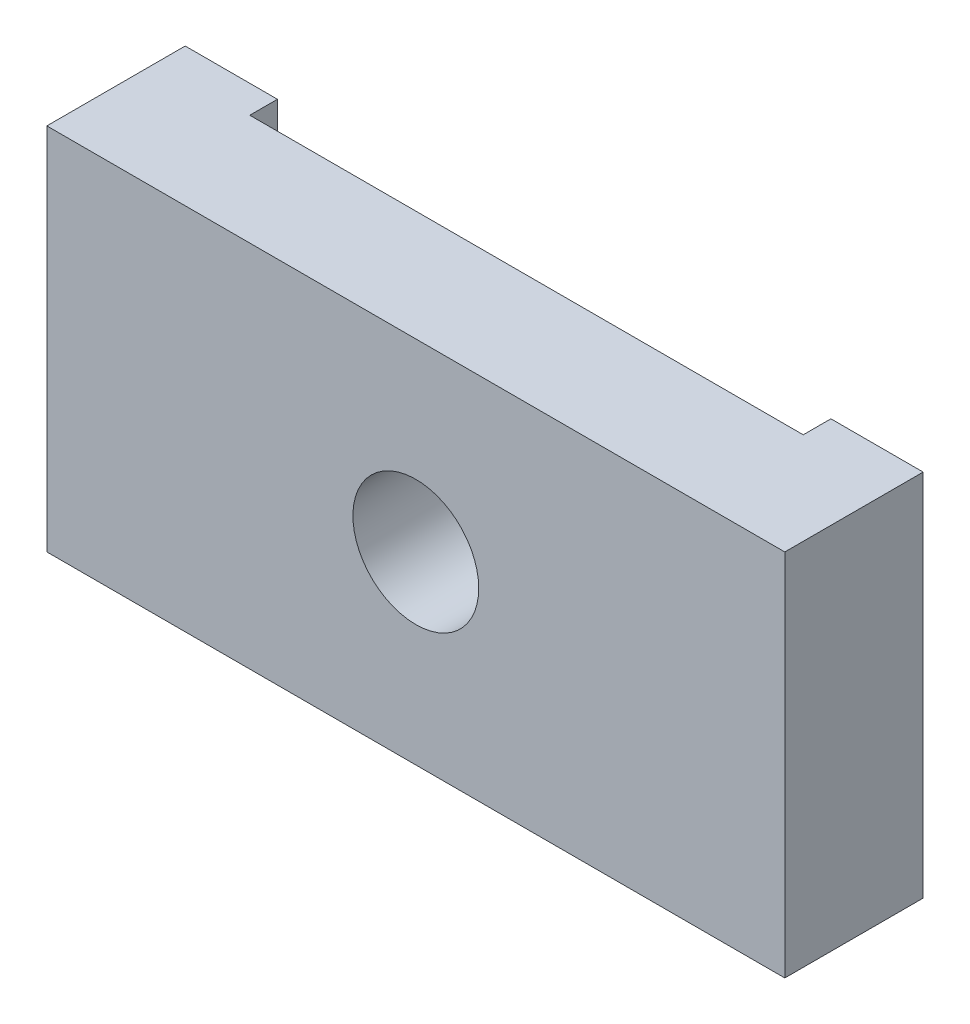
ISO-10303-21;
HEADER;
FILE_DESCRIPTION(('STEP AP214'),'2;1');
FILE_NAME('part.step','',(''),(''),'','','');
FILE_SCHEMA(('AUTOMOTIVE_DESIGN { 1 0 10303 214 1 1 1 1 }'));
ENDSEC;
DATA;
#1=APPLICATION_CONTEXT('core data for automotive mechanical design processes');
#2=APPLICATION_PROTOCOL_DEFINITION('international standard','automotive_design',2000,#1);
#3=PRODUCT_CONTEXT('',#1,'mechanical');
#4=PRODUCT('Part','Part','',(#3));
#5=PRODUCT_RELATED_PRODUCT_CATEGORY('part','',(#4));
#6=PRODUCT_DEFINITION_FORMATION('','',#4);
#7=PRODUCT_DEFINITION_CONTEXT('part definition',#1,'design');
#8=PRODUCT_DEFINITION('design','',#6,#7);
#9=PRODUCT_DEFINITION_SHAPE('','',#8);
#10=(LENGTH_UNIT() NAMED_UNIT(*) SI_UNIT(.MILLI.,.METRE.));
#11=(NAMED_UNIT(*) PLANE_ANGLE_UNIT() SI_UNIT($,.RADIAN.));
#12=(NAMED_UNIT(*) SI_UNIT($,.STERADIAN.) SOLID_ANGLE_UNIT());
#13=UNCERTAINTY_MEASURE_WITH_UNIT(LENGTH_MEASURE(1.E-05),#10,'distance_accuracy_value','');
#14=(GEOMETRIC_REPRESENTATION_CONTEXT(3) GLOBAL_UNCERTAINTY_ASSIGNED_CONTEXT((#13)) GLOBAL_UNIT_ASSIGNED_CONTEXT((#10,
#11,#12)) REPRESENTATION_CONTEXT('',''));
#15=CARTESIAN_POINT('',(0.,0.,0.));
#16=DIRECTION('',(0.,0.,1.));
#17=DIRECTION('',(1.,0.,0.));
#18=AXIS2_PLACEMENT_3D('',#15,#16,#17);
#19=CARTESIAN_POINT('',(0.,0.,-48.0642839424142));
#20=DIRECTION('',(0.,0.,1.));
#21=DIRECTION('',(1.,0.,0.));
#22=AXIS2_PLACEMENT_3D('',#19,#20,#21);
#23=CYLINDRICAL_SURFACE('',#22,4.3307);
#24=CARTESIAN_POINT('',(0.,0.,1.905));
#25=DIRECTION('',(0.,0.,1.));
#26=DIRECTION('',(1.,0.,0.));
#27=AXIS2_PLACEMENT_3D('',#24,#25,#26);
#28=CIRCLE('',#27,4.3307);
#29=CARTESIAN_POINT('',(4.3307,0.,1.905));
#30=VERTEX_POINT('',#29);
#31=EDGE_CURVE('E199',#30,#30,#28,.T.);
#32=ORIENTED_EDGE('',*,*,#31,.F.);
#33=EDGE_LOOP('',(#32));
#34=FACE_BOUND('',#33,.T.);
#35=CARTESIAN_POINT('',(0.,0.,9.525));
#36=DIRECTION('',(0.,0.,-1.));
#37=DIRECTION('',(0.,-1.,0.));
#38=AXIS2_PLACEMENT_3D('',#35,#36,#37);
#39=CIRCLE('',#38,4.3307);
#40=CARTESIAN_POINT('',(0.,-4.3307,9.525));
#41=VERTEX_POINT('',#40);
#42=EDGE_CURVE('E138',#41,#41,#39,.T.);
#43=ORIENTED_EDGE('',*,*,#42,.F.);
#44=EDGE_LOOP('',(#43));
#45=FACE_BOUND('',#44,.T.);
#46=ADVANCED_FACE('F15',(#34,#45),#23,.F.);
#47=CARTESIAN_POINT('',(22.225,-7.9375,6.90324241496963));
#48=DIRECTION('',(0.,0.,-1.));
#49=DIRECTION('',(1.,0.,0.));
#50=AXIS2_PLACEMENT_3D('',#47,#48,#49);
#51=CONICAL_SURFACE('',#50,0.92075,1.02974425867665);
#52=CARTESIAN_POINT('',(22.225,-7.9375,7.45648482993925));
#53=VERTEX_POINT('',#52);
#54=VERTEX_LOOP('',#53);
#55=FACE_BOUND('',#54,.T.);
#56=CARTESIAN_POINT('',(22.225,-7.9375,6.35));
#57=DIRECTION('',(0.,0.,1.));
#58=DIRECTION('',(1.,0.,0.));
#59=AXIS2_PLACEMENT_3D('',#56,#57,#58);
#60=CIRCLE('',#59,1.8415);
#61=CARTESIAN_POINT('',(24.0665,-7.9375,6.35));
#62=VERTEX_POINT('',#61);
#63=EDGE_CURVE('E9',#62,#62,#60,.T.);
#64=ORIENTED_EDGE('',*,*,#63,.F.);
#65=EDGE_LOOP('',(#64));
#66=FACE_BOUND('',#65,.T.);
#67=ADVANCED_FACE('F217',(#55,#66),#51,.F.);
#68=CARTESIAN_POINT('',(22.225,-7.9375,3.175));
#69=DIRECTION('',(0.,0.,1.));
#70=DIRECTION('',(1.,0.,0.));
#71=AXIS2_PLACEMENT_3D('',#68,#69,#70);
#72=CYLINDRICAL_SURFACE('',#71,1.8415);
#73=CARTESIAN_POINT('',(22.225,-7.9375,0.));
#74=DIRECTION('',(0.,0.,1.));
#75=DIRECTION('',(1.,0.,0.));
#76=AXIS2_PLACEMENT_3D('',#73,#74,#75);
#77=CIRCLE('',#76,1.8415);
#78=CARTESIAN_POINT('',(24.0665,-7.9375,0.));
#79=VERTEX_POINT('',#78);
#80=EDGE_CURVE('E134',#79,#79,#77,.T.);
#81=ORIENTED_EDGE('',*,*,#80,.F.);
#82=EDGE_LOOP('',(#81));
#83=FACE_BOUND('',#82,.T.);
#84=ORIENTED_EDGE('',*,*,#63,.T.);
#85=EDGE_LOOP('',(#84));
#86=FACE_BOUND('',#85,.T.);
#87=ADVANCED_FACE('F223',(#83,#86),#72,.F.);
#88=CARTESIAN_POINT('',(22.225,7.9375,6.90324241496963));
#89=DIRECTION('',(0.,0.,-1.));
#90=DIRECTION('',(1.,0.,0.));
#91=AXIS2_PLACEMENT_3D('',#88,#89,#90);
#92=CONICAL_SURFACE('',#91,0.92075,1.02974425867665);
#93=CARTESIAN_POINT('',(22.225,7.9375,7.45648482993925));
#94=VERTEX_POINT('',#93);
#95=VERTEX_LOOP('',#94);
#96=FACE_BOUND('',#95,.T.);
#97=CARTESIAN_POINT('',(22.225,7.9375,6.35));
#98=DIRECTION('',(0.,0.,1.));
#99=DIRECTION('',(1.,0.,0.));
#100=AXIS2_PLACEMENT_3D('',#97,#98,#99);
#101=CIRCLE('',#100,1.8415);
#102=CARTESIAN_POINT('',(24.0665,7.9375,6.35));
#103=VERTEX_POINT('',#102);
#104=EDGE_CURVE('E24',#103,#103,#101,.T.);
#105=ORIENTED_EDGE('',*,*,#104,.F.);
#106=EDGE_LOOP('',(#105));
#107=FACE_BOUND('',#106,.T.);
#108=ADVANCED_FACE('F259',(#96,#107),#92,.F.);
#109=CARTESIAN_POINT('',(22.225,7.9375,3.175));
#110=DIRECTION('',(0.,0.,1.));
#111=DIRECTION('',(1.,0.,0.));
#112=AXIS2_PLACEMENT_3D('',#109,#110,#111);
#113=CYLINDRICAL_SURFACE('',#112,1.8415);
#114=CARTESIAN_POINT('',(22.225,7.9375,0.));
#115=DIRECTION('',(0.,0.,1.));
#116=DIRECTION('',(1.,0.,0.));
#117=AXIS2_PLACEMENT_3D('',#114,#115,#116);
#118=CIRCLE('',#117,1.8415);
#119=CARTESIAN_POINT('',(24.0665,7.9375,0.));
#120=VERTEX_POINT('',#119);
#121=EDGE_CURVE('E181',#120,#120,#118,.T.);
#122=ORIENTED_EDGE('',*,*,#121,.F.);
#123=EDGE_LOOP('',(#122));
#124=FACE_BOUND('',#123,.T.);
#125=ORIENTED_EDGE('',*,*,#104,.T.);
#126=EDGE_LOOP('',(#125));
#127=FACE_BOUND('',#126,.T.);
#128=ADVANCED_FACE('F17',(#124,#127),#113,.F.);
#129=CARTESIAN_POINT('',(-22.225,-7.9375,6.90324241496963));
#130=DIRECTION('',(0.,0.,-1.));
#131=DIRECTION('',(0.,-1.,0.));
#132=AXIS2_PLACEMENT_3D('',#129,#130,#131);
#133=CONICAL_SURFACE('',#132,0.92075,1.02974425867665);
#134=CARTESIAN_POINT('',(-22.225,-7.9375,7.45648482993925));
#135=VERTEX_POINT('',#134);
#136=VERTEX_LOOP('',#135);
#137=FACE_BOUND('',#136,.T.);
#138=CARTESIAN_POINT('',(-22.225,-7.9375,6.35));
#139=DIRECTION('',(0.,0.,-1.));
#140=DIRECTION('',(0.,-1.,0.));
#141=AXIS2_PLACEMENT_3D('',#138,#139,#140);
#142=CIRCLE('',#141,1.8415);
#143=CARTESIAN_POINT('',(-22.225,-9.779,6.35));
#144=VERTEX_POINT('',#143);
#145=EDGE_CURVE('E190',#144,#144,#142,.T.);
#146=ORIENTED_EDGE('',*,*,#145,.T.);
#147=EDGE_LOOP('',(#146));
#148=FACE_BOUND('',#147,.T.);
#149=ADVANCED_FACE('F229',(#137,#148),#133,.F.);
#150=CARTESIAN_POINT('',(-22.225,-7.9375,3.175));
#151=DIRECTION('',(0.,0.,-1.));
#152=DIRECTION('',(0.,-1.,0.));
#153=AXIS2_PLACEMENT_3D('',#150,#151,#152);
#154=CYLINDRICAL_SURFACE('',#153,1.8415);
#155=CARTESIAN_POINT('',(-22.225,-7.9375,0.));
#156=DIRECTION('',(0.,0.,1.));
#157=DIRECTION('',(1.,0.,0.));
#158=AXIS2_PLACEMENT_3D('',#155,#156,#157);
#159=CIRCLE('',#158,1.8415);
#160=CARTESIAN_POINT('',(-20.3835,-7.9375,0.));
#161=VERTEX_POINT('',#160);
#162=EDGE_CURVE('E194',#161,#161,#159,.T.);
#163=ORIENTED_EDGE('',*,*,#162,.F.);
#164=EDGE_LOOP('',(#163));
#165=FACE_BOUND('',#164,.T.);
#166=ORIENTED_EDGE('',*,*,#145,.F.);
#167=EDGE_LOOP('',(#166));
#168=FACE_BOUND('',#167,.T.);
#169=ADVANCED_FACE('F232',(#165,#168),#154,.F.);
#170=CARTESIAN_POINT('',(-22.225,7.9375,6.90324241496963));
#171=DIRECTION('',(0.,0.,-1.));
#172=DIRECTION('',(0.,-1.,0.));
#173=AXIS2_PLACEMENT_3D('',#170,#171,#172);
#174=CONICAL_SURFACE('',#173,0.92075,1.02974425867665);
#175=CARTESIAN_POINT('',(-22.225,7.9375,7.45648482993925));
#176=VERTEX_POINT('',#175);
#177=VERTEX_LOOP('',#176);
#178=FACE_BOUND('',#177,.T.);
#179=CARTESIAN_POINT('',(-22.225,7.9375,6.35));
#180=DIRECTION('',(0.,0.,-1.));
#181=DIRECTION('',(0.,-1.,0.));
#182=AXIS2_PLACEMENT_3D('',#179,#180,#181);
#183=CIRCLE('',#182,1.8415);
#184=CARTESIAN_POINT('',(-22.225,6.096,6.35));
#185=VERTEX_POINT('',#184);
#186=EDGE_CURVE('E193',#185,#185,#183,.T.);
#187=ORIENTED_EDGE('',*,*,#186,.T.);
#188=EDGE_LOOP('',(#187));
#189=FACE_BOUND('',#188,.T.);
#190=ADVANCED_FACE('F235',(#178,#189),#174,.F.);
#191=CARTESIAN_POINT('',(-22.225,7.9375,3.175));
#192=DIRECTION('',(0.,0.,-1.));
#193=DIRECTION('',(0.,-1.,0.));
#194=AXIS2_PLACEMENT_3D('',#191,#192,#193);
#195=CYLINDRICAL_SURFACE('',#194,1.8415);
#196=CARTESIAN_POINT('',(-22.225,7.9375,0.));
#197=DIRECTION('',(0.,0.,1.));
#198=DIRECTION('',(1.,0.,0.));
#199=AXIS2_PLACEMENT_3D('',#196,#197,#198);
#200=CIRCLE('',#199,1.8415);
#201=CARTESIAN_POINT('',(-20.3835,7.9375,0.));
#202=VERTEX_POINT('',#201);
#203=EDGE_CURVE('E119',#202,#202,#200,.T.);
#204=ORIENTED_EDGE('',*,*,#203,.F.);
#205=EDGE_LOOP('',(#204));
#206=FACE_BOUND('',#205,.T.);
#207=ORIENTED_EDGE('',*,*,#186,.F.);
#208=EDGE_LOOP('',(#207));
#209=FACE_BOUND('',#208,.T.);
#210=ADVANCED_FACE('F213',(#206,#209),#195,.F.);
#211=CARTESIAN_POINT('',(-19.05,12.7,1.905));
#212=DIRECTION('',(0.,0.,1.));
#213=DIRECTION('',(1.,0.,0.));
#214=AXIS2_PLACEMENT_3D('',#211,#212,#213);
#215=PLANE('',#214);
#216=ORIENTED_EDGE('',*,*,#31,.T.);
#217=EDGE_LOOP('',(#216));
#218=FACE_BOUND('',#217,.T.);
#219=DIRECTION('',(1.,0.,0.));
#220=VECTOR('',#219,1.);
#221=CARTESIAN_POINT('',(3.175,-12.7,1.905));
#222=LINE('',#221,#220);
#223=CARTESIAN_POINT('',(-19.05,-12.7,1.905));
#224=VERTEX_POINT('',#223);
#225=CARTESIAN_POINT('',(19.05,-12.7,1.905));
#226=VERTEX_POINT('',#225);
#227=EDGE_CURVE('E88',#224,#226,#222,.T.);
#228=ORIENTED_EDGE('',*,*,#227,.F.);
#229=DIRECTION('',(0.,-1.,0.));
#230=VECTOR('',#229,1.);
#231=CARTESIAN_POINT('',(-19.05,12.7,1.905));
#232=LINE('',#231,#230);
#233=CARTESIAN_POINT('',(-19.05,12.7,1.905));
#234=VERTEX_POINT('',#233);
#235=EDGE_CURVE('E91',#234,#224,#232,.T.);
#236=ORIENTED_EDGE('',*,*,#235,.F.);
#237=DIRECTION('',(-1.,0.,0.));
#238=VECTOR('',#237,1.);
#239=CARTESIAN_POINT('',(-22.225,12.7,1.905));
#240=LINE('',#239,#238);
#241=CARTESIAN_POINT('',(19.05,12.7,1.905));
#242=VERTEX_POINT('',#241);
#243=EDGE_CURVE('E121',#242,#234,#240,.T.);
#244=ORIENTED_EDGE('',*,*,#243,.F.);
#245=DIRECTION('',(0.,-1.,0.));
#246=VECTOR('',#245,1.);
#247=CARTESIAN_POINT('',(19.05,12.7,1.905));
#248=LINE('',#247,#246);
#249=EDGE_CURVE('E94',#242,#226,#248,.T.);
#250=ORIENTED_EDGE('',*,*,#249,.T.);
#251=EDGE_LOOP('',(#228,#236,#244,#250));
#252=FACE_BOUND('',#251,.T.);
#253=ADVANCED_FACE('F90',(#218,#252),#215,.F.);
#254=CARTESIAN_POINT('',(19.05,12.7,1.905));
#255=DIRECTION('',(1.,0.,0.));
#256=DIRECTION('',(0.,0.,-1.));
#257=AXIS2_PLACEMENT_3D('',#254,#255,#256);
#258=PLANE('',#257);
#259=DIRECTION('',(0.,0.,-1.));
#260=VECTOR('',#259,1.);
#261=CARTESIAN_POINT('',(19.05,-12.7,0.9525));
#262=LINE('',#261,#260);
#263=CARTESIAN_POINT('',(19.05,-12.7,0.));
#264=VERTEX_POINT('',#263);
#265=EDGE_CURVE('E100',#226,#264,#262,.T.);
#266=ORIENTED_EDGE('',*,*,#265,.F.);
#267=ORIENTED_EDGE('',*,*,#249,.F.);
#268=DIRECTION('',(0.,0.,1.));
#269=VECTOR('',#268,1.);
#270=CARTESIAN_POINT('',(19.05,12.7,0.9525));
#271=LINE('',#270,#269);
#272=CARTESIAN_POINT('',(19.05,12.7,0.));
#273=VERTEX_POINT('',#272);
#274=EDGE_CURVE('E127',#273,#242,#271,.T.);
#275=ORIENTED_EDGE('',*,*,#274,.F.);
#276=DIRECTION('',(0.,1.,0.));
#277=VECTOR('',#276,1.);
#278=CARTESIAN_POINT('',(19.05,6.35,0.));
#279=LINE('',#278,#277);
#280=EDGE_CURVE('E115',#264,#273,#279,.T.);
#281=ORIENTED_EDGE('',*,*,#280,.F.);
#282=EDGE_LOOP('',(#266,#267,#275,#281));
#283=FACE_BOUND('',#282,.T.);
#284=ADVANCED_FACE('F204',(#283),#258,.F.);
#285=CARTESIAN_POINT('',(-19.05,12.7,0.));
#286=DIRECTION('',(-1.,0.,0.));
#287=DIRECTION('',(0.,0.,1.));
#288=AXIS2_PLACEMENT_3D('',#285,#286,#287);
#289=PLANE('',#288);
#290=DIRECTION('',(0.,0.,1.));
#291=VECTOR('',#290,1.);
#292=CARTESIAN_POINT('',(-19.05,-12.7,0.));
#293=LINE('',#292,#291);
#294=CARTESIAN_POINT('',(-19.05,-12.7,0.));
#295=VERTEX_POINT('',#294);
#296=EDGE_CURVE('E99',#295,#224,#293,.T.);
#297=ORIENTED_EDGE('',*,*,#296,.F.);
#298=DIRECTION('',(0.,-1.,0.));
#299=VECTOR('',#298,1.);
#300=CARTESIAN_POINT('',(-19.05,6.35,0.));
#301=LINE('',#300,#299);
#302=CARTESIAN_POINT('',(-19.05,12.7,0.));
#303=VERTEX_POINT('',#302);
#304=EDGE_CURVE('E117',#303,#295,#301,.T.);
#305=ORIENTED_EDGE('',*,*,#304,.F.);
#306=DIRECTION('',(0.,0.,-1.));
#307=VECTOR('',#306,1.);
#308=CARTESIAN_POINT('',(-19.05,12.7,0.));
#309=LINE('',#308,#307);
#310=EDGE_CURVE('E107',#234,#303,#309,.T.);
#311=ORIENTED_EDGE('',*,*,#310,.F.);
#312=ORIENTED_EDGE('',*,*,#235,.T.);
#313=EDGE_LOOP('',(#297,#305,#311,#312));
#314=FACE_BOUND('',#313,.T.);
#315=ADVANCED_FACE('F104',(#314),#289,.F.);
#316=CARTESIAN_POINT('',(25.4,-12.7,0.));
#317=DIRECTION('',(0.,-1.,0.));
#318=DIRECTION('',(0.,0.,-1.));
#319=AXIS2_PLACEMENT_3D('',#316,#317,#318);
#320=PLANE('',#319);
#321=ORIENTED_EDGE('',*,*,#296,.T.);
#322=ORIENTED_EDGE('',*,*,#227,.T.);
#323=ORIENTED_EDGE('',*,*,#265,.T.);
#324=DIRECTION('',(-1.,0.,0.));
#325=VECTOR('',#324,1.);
#326=CARTESIAN_POINT('',(25.4,-12.7,0.));
#327=LINE('',#326,#325);
#328=CARTESIAN_POINT('',(25.4,-12.7,0.));
#329=VERTEX_POINT('',#328);
#330=EDGE_CURVE('E123',#329,#264,#327,.T.);
#331=ORIENTED_EDGE('',*,*,#330,.F.);
#332=DIRECTION('',(0.,0.,1.));
#333=VECTOR('',#332,1.);
#334=CARTESIAN_POINT('',(25.4,-12.7,0.));
#335=LINE('',#334,#333);
#336=CARTESIAN_POINT('',(25.4,-12.7,9.525));
#337=VERTEX_POINT('',#336);
#338=EDGE_CURVE('E128',#329,#337,#335,.T.);
#339=ORIENTED_EDGE('',*,*,#338,.T.);
#340=DIRECTION('',(-1.,0.,0.));
#341=VECTOR('',#340,1.);
#342=CARTESIAN_POINT('',(25.4,-12.7,9.525));
#343=LINE('',#342,#341);
#344=CARTESIAN_POINT('',(-25.4,-12.7,9.525));
#345=VERTEX_POINT('',#344);
#346=EDGE_CURVE('E131',#337,#345,#343,.T.);
#347=ORIENTED_EDGE('',*,*,#346,.T.);
#348=DIRECTION('',(0.,0.,1.));
#349=VECTOR('',#348,1.);
#350=CARTESIAN_POINT('',(-25.4,-12.7,0.));
#351=LINE('',#350,#349);
#352=CARTESIAN_POINT('',(-25.4,-12.7,0.));
#353=VERTEX_POINT('',#352);
#354=EDGE_CURVE('E135',#353,#345,#351,.T.);
#355=ORIENTED_EDGE('',*,*,#354,.F.);
#356=DIRECTION('',(-1.,0.,0.));
#357=VECTOR('',#356,1.);
#358=CARTESIAN_POINT('',(25.4,-12.7,0.));
#359=LINE('',#358,#357);
#360=EDGE_CURVE('E111',#295,#353,#359,.T.);
#361=ORIENTED_EDGE('',*,*,#360,.F.);
#362=EDGE_LOOP('',(#321,#322,#323,#331,#339,#347,#355,#361));
#363=FACE_BOUND('',#362,.T.);
#364=ADVANCED_FACE('F109',(#363),#320,.T.);
#365=CARTESIAN_POINT('',(0.,0.,0.));
#366=DIRECTION('',(0.,0.,1.));
#367=DIRECTION('',(1.,0.,0.));
#368=AXIS2_PLACEMENT_3D('',#365,#366,#367);
#369=PLANE('',#368);
#370=ORIENTED_EDGE('',*,*,#80,.T.);
#371=EDGE_LOOP('',(#370));
#372=FACE_BOUND('',#371,.T.);
#373=ORIENTED_EDGE('',*,*,#121,.T.);
#374=EDGE_LOOP('',(#373));
#375=FACE_BOUND('',#374,.T.);
#376=ORIENTED_EDGE('',*,*,#280,.T.);
#377=DIRECTION('',(1.,0.,0.));
#378=VECTOR('',#377,1.);
#379=CARTESIAN_POINT('',(-25.4,12.7,0.));
#380=LINE('',#379,#378);
#381=CARTESIAN_POINT('',(25.4,12.7,0.));
#382=VERTEX_POINT('',#381);
#383=EDGE_CURVE('E140',#273,#382,#380,.T.);
#384=ORIENTED_EDGE('',*,*,#383,.T.);
#385=DIRECTION('',(0.,-1.,0.));
#386=VECTOR('',#385,1.);
#387=CARTESIAN_POINT('',(25.4,12.7,0.));
#388=LINE('',#387,#386);
#389=EDGE_CURVE('E126',#382,#329,#388,.T.);
#390=ORIENTED_EDGE('',*,*,#389,.T.);
#391=ORIENTED_EDGE('',*,*,#330,.T.);
#392=EDGE_LOOP('',(#376,#384,#390,#391));
#393=FACE_BOUND('',#392,.T.);
#394=ADVANCED_FACE('F179',(#372,#375,#393),#369,.F.);
#395=CARTESIAN_POINT('',(-25.4,12.7,0.));
#396=DIRECTION('',(0.,1.,0.));
#397=DIRECTION('',(0.,0.,1.));
#398=AXIS2_PLACEMENT_3D('',#395,#396,#397);
#399=PLANE('',#398);
#400=ORIENTED_EDGE('',*,*,#274,.T.);
#401=ORIENTED_EDGE('',*,*,#243,.T.);
#402=ORIENTED_EDGE('',*,*,#310,.T.);
#403=DIRECTION('',(1.,0.,0.));
#404=VECTOR('',#403,1.);
#405=CARTESIAN_POINT('',(-25.4,12.7,0.));
#406=LINE('',#405,#404);
#407=CARTESIAN_POINT('',(-25.4,12.7,0.));
#408=VERTEX_POINT('',#407);
#409=EDGE_CURVE('E145',#408,#303,#406,.T.);
#410=ORIENTED_EDGE('',*,*,#409,.F.);
#411=DIRECTION('',(0.,0.,1.));
#412=VECTOR('',#411,1.);
#413=CARTESIAN_POINT('',(-25.4,12.7,0.));
#414=LINE('',#413,#412);
#415=CARTESIAN_POINT('',(-25.4,12.7,9.525));
#416=VERTEX_POINT('',#415);
#417=EDGE_CURVE('E122',#408,#416,#414,.T.);
#418=ORIENTED_EDGE('',*,*,#417,.T.);
#419=DIRECTION('',(1.,0.,0.));
#420=VECTOR('',#419,1.);
#421=CARTESIAN_POINT('',(-25.4,12.7,9.525));
#422=LINE('',#421,#420);
#423=CARTESIAN_POINT('',(25.4,12.7,9.525));
#424=VERTEX_POINT('',#423);
#425=EDGE_CURVE('E150',#416,#424,#422,.T.);
#426=ORIENTED_EDGE('',*,*,#425,.T.);
#427=DIRECTION('',(0.,0.,1.));
#428=VECTOR('',#427,1.);
#429=CARTESIAN_POINT('',(25.4,12.7,0.));
#430=LINE('',#429,#428);
#431=EDGE_CURVE('E154',#382,#424,#430,.T.);
#432=ORIENTED_EDGE('',*,*,#431,.F.);
#433=ORIENTED_EDGE('',*,*,#383,.F.);
#434=EDGE_LOOP('',(#400,#401,#402,#410,#418,#426,#432,#433));
#435=FACE_BOUND('',#434,.T.);
#436=ADVANCED_FACE('F170',(#435),#399,.T.);
#437=CARTESIAN_POINT('',(25.4,12.7,0.));
#438=DIRECTION('',(1.,0.,0.));
#439=DIRECTION('',(0.,0.,-1.));
#440=AXIS2_PLACEMENT_3D('',#437,#438,#439);
#441=PLANE('',#440);
#442=DIRECTION('',(0.,-1.,0.));
#443=VECTOR('',#442,1.);
#444=CARTESIAN_POINT('',(25.4,12.7,9.525));
#445=LINE('',#444,#443);
#446=EDGE_CURVE('E153',#424,#337,#445,.T.);
#447=ORIENTED_EDGE('',*,*,#446,.T.);
#448=ORIENTED_EDGE('',*,*,#338,.F.);
#449=ORIENTED_EDGE('',*,*,#389,.F.);
#450=ORIENTED_EDGE('',*,*,#431,.T.);
#451=EDGE_LOOP('',(#447,#448,#449,#450));
#452=FACE_BOUND('',#451,.T.);
#453=ADVANCED_FACE('F175',(#452),#441,.T.);
#454=CARTESIAN_POINT('',(-25.4,-12.7,0.));
#455=DIRECTION('',(-1.,0.,0.));
#456=DIRECTION('',(0.,0.,1.));
#457=AXIS2_PLACEMENT_3D('',#454,#455,#456);
#458=PLANE('',#457);
#459=DIRECTION('',(0.,1.,0.));
#460=VECTOR('',#459,1.);
#461=CARTESIAN_POINT('',(-25.4,-12.7,9.525));
#462=LINE('',#461,#460);
#463=EDGE_CURVE('E137',#345,#416,#462,.T.);
#464=ORIENTED_EDGE('',*,*,#463,.T.);
#465=ORIENTED_EDGE('',*,*,#417,.F.);
#466=DIRECTION('',(0.,1.,0.));
#467=VECTOR('',#466,1.);
#468=CARTESIAN_POINT('',(-25.4,-12.7,0.));
#469=LINE('',#468,#467);
#470=EDGE_CURVE('E19',#353,#408,#469,.T.);
#471=ORIENTED_EDGE('',*,*,#470,.F.);
#472=ORIENTED_EDGE('',*,*,#354,.T.);
#473=EDGE_LOOP('',(#464,#465,#471,#472));
#474=FACE_BOUND('',#473,.T.);
#475=ADVANCED_FACE('F161',(#474),#458,.T.);
#476=CARTESIAN_POINT('',(0.,0.,9.525));
#477=DIRECTION('',(0.,0.,1.));
#478=DIRECTION('',(1.,0.,0.));
#479=AXIS2_PLACEMENT_3D('',#476,#477,#478);
#480=PLANE('',#479);
#481=ORIENTED_EDGE('',*,*,#42,.T.);
#482=EDGE_LOOP('',(#481));
#483=FACE_BOUND('',#482,.T.);
#484=ORIENTED_EDGE('',*,*,#446,.F.);
#485=ORIENTED_EDGE('',*,*,#425,.F.);
#486=ORIENTED_EDGE('',*,*,#463,.F.);
#487=ORIENTED_EDGE('',*,*,#346,.F.);
#488=EDGE_LOOP('',(#484,#485,#486,#487));
#489=FACE_BOUND('',#488,.T.);
#490=ADVANCED_FACE('F166',(#483,#489),#480,.T.);
#491=CARTESIAN_POINT('',(0.,0.,0.));
#492=DIRECTION('',(0.,0.,1.));
#493=DIRECTION('',(1.,0.,0.));
#494=AXIS2_PLACEMENT_3D('',#491,#492,#493);
#495=PLANE('',#494);
#496=ORIENTED_EDGE('',*,*,#162,.T.);
#497=EDGE_LOOP('',(#496));
#498=FACE_BOUND('',#497,.T.);
#499=ORIENTED_EDGE('',*,*,#203,.T.);
#500=EDGE_LOOP('',(#499));
#501=FACE_BOUND('',#500,.T.);
#502=ORIENTED_EDGE('',*,*,#304,.T.);
#503=ORIENTED_EDGE('',*,*,#360,.T.);
#504=ORIENTED_EDGE('',*,*,#470,.T.);
#505=ORIENTED_EDGE('',*,*,#409,.T.);
#506=EDGE_LOOP('',(#502,#503,#504,#505));
#507=FACE_BOUND('',#506,.T.);
#508=ADVANCED_FACE('F172',(#498,#501,#507),#495,.F.);
#509=CLOSED_SHELL('',(#46,#67,#87,#108,#128,#149,#169,#190,#210,#253,#284,#315,#364,#394,#436,
#453,#475,#490,#508));
#510=MANIFOLD_SOLID_BREP('B1',#509);
#511=ADVANCED_BREP_SHAPE_REPRESENTATION('',(#18,#510),#14);
#512=SHAPE_DEFINITION_REPRESENTATION(#9,#511);
ENDSEC;
END-ISO-10303-21;
